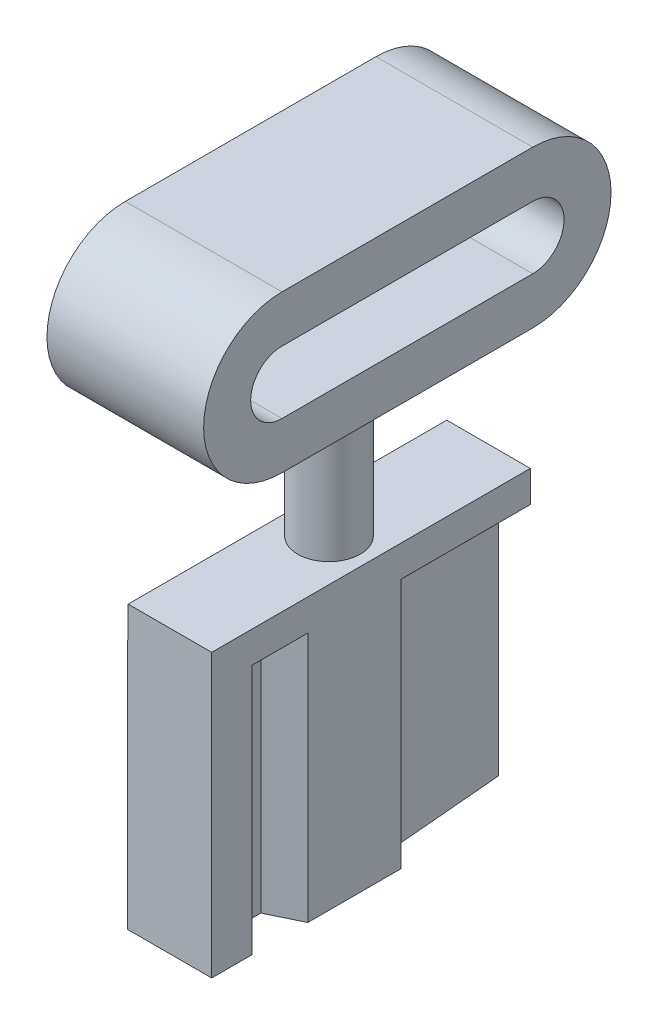
ISO-10303-21;
HEADER;
FILE_DESCRIPTION(('STEP AP214'),'2;1');
FILE_NAME('part.step','',(''),(''),'','','');
FILE_SCHEMA(('AUTOMOTIVE_DESIGN { 1 0 10303 214 1 1 1 1 }'));
ENDSEC;
DATA;
#1=APPLICATION_CONTEXT('core data for automotive mechanical design processes');
#2=APPLICATION_PROTOCOL_DEFINITION('international standard','automotive_design',2000,#1);
#3=PRODUCT_CONTEXT('',#1,'mechanical');
#4=PRODUCT('Part','Part','',(#3));
#5=PRODUCT_RELATED_PRODUCT_CATEGORY('part','',(#4));
#6=PRODUCT_DEFINITION_FORMATION('','',#4);
#7=PRODUCT_DEFINITION_CONTEXT('part definition',#1,'design');
#8=PRODUCT_DEFINITION('design','',#6,#7);
#9=PRODUCT_DEFINITION_SHAPE('','',#8);
#10=(LENGTH_UNIT() NAMED_UNIT(*) SI_UNIT(.MILLI.,.METRE.));
#11=(NAMED_UNIT(*) PLANE_ANGLE_UNIT() SI_UNIT($,.RADIAN.));
#12=(NAMED_UNIT(*) SI_UNIT($,.STERADIAN.) SOLID_ANGLE_UNIT());
#13=UNCERTAINTY_MEASURE_WITH_UNIT(LENGTH_MEASURE(1.E-05),#10,'distance_accuracy_value','');
#14=(GEOMETRIC_REPRESENTATION_CONTEXT(3) GLOBAL_UNCERTAINTY_ASSIGNED_CONTEXT((#13)) GLOBAL_UNIT_ASSIGNED_CONTEXT((#10,
#11,#12)) REPRESENTATION_CONTEXT('',''));
#15=CARTESIAN_POINT('',(0.,0.,0.));
#16=DIRECTION('',(0.,0.,1.));
#17=DIRECTION('',(1.,0.,0.));
#18=AXIS2_PLACEMENT_3D('',#15,#16,#17);
#19=CARTESIAN_POINT('',(0.,0.,0.));
#20=DIRECTION('',(0.,-1.,0.));
#21=DIRECTION('',(0.,0.,-1.));
#22=AXIS2_PLACEMENT_3D('',#19,#20,#21);
#23=PLANE('',#22);
#24=DIRECTION('',(0.,0.,1.));
#25=VECTOR('',#24,1.);
#26=CARTESIAN_POINT('',(-1.32550575745283,0.,5.08353990529874));
#27=LINE('',#26,#25);
#28=CARTESIAN_POINT('',(-1.32550575745283,0.,1.49301254358988));
#29=VERTEX_POINT('',#28);
#30=CARTESIAN_POINT('',(-1.32550575745283,0.,5.08353990529874));
#31=VERTEX_POINT('',#30);
#32=EDGE_CURVE('E46',#29,#31,#27,.T.);
#33=ORIENTED_EDGE('',*,*,#32,.F.);
#34=DIRECTION('',(-0.977998261827923,0.,0.208613038570365));
#35=VECTOR('',#34,1.);
#36=CARTESIAN_POINT('',(-1.34056311456887,0.,1.49622437038285));
#37=LINE('',#36,#35);
#38=CARTESIAN_POINT('',(-1.34056311456887,0.,1.49622437038285));
#39=VERTEX_POINT('',#38);
#40=EDGE_CURVE('E210',#29,#39,#37,.T.);
#41=ORIENTED_EDGE('',*,*,#40,.T.);
#42=DIRECTION('',(0.,0.,1.));
#43=VECTOR('',#42,1.);
#44=CARTESIAN_POINT('',(-1.34056311456887,0.,5.08353990529874));
#45=LINE('',#44,#43);
#46=CARTESIAN_POINT('',(-1.34056311456887,0.,5.08353990529874));
#47=VERTEX_POINT('',#46);
#48=EDGE_CURVE('E212',#39,#47,#45,.T.);
#49=ORIENTED_EDGE('',*,*,#48,.T.);
#50=DIRECTION('',(1.,0.,0.));
#51=VECTOR('',#50,1.);
#52=CARTESIAN_POINT('',(1.34056311456887,0.,5.08353990529874));
#53=LINE('',#52,#51);
#54=EDGE_CURVE('E184',#47,#31,#53,.T.);
#55=ORIENTED_EDGE('',*,*,#54,.T.);
#56=EDGE_LOOP('',(#33,#41,#49,#55));
#57=FACE_BOUND('',#56,.T.);
#58=ADVANCED_FACE('F37',(#57),#23,.F.);
#59=CARTESIAN_POINT('',(1.34056311456887,-8.,5.08353990529874));
#60=DIRECTION('',(0.,0.,1.));
#61=DIRECTION('',(1.,0.,0.));
#62=AXIS2_PLACEMENT_3D('',#59,#60,#61);
#63=PLANE('',#62);
#64=ORIENTED_EDGE('',*,*,#54,.F.);
#65=DIRECTION('',(0.,1.,0.));
#66=VECTOR('',#65,1.);
#67=CARTESIAN_POINT('',(-1.34056311456887,-8.,5.08353990529874));
#68=LINE('',#67,#66);
#69=CARTESIAN_POINT('',(-1.34056311456887,-8.,5.08353990529874));
#70=VERTEX_POINT('',#69);
#71=EDGE_CURVE('E62',#70,#47,#68,.T.);
#72=ORIENTED_EDGE('',*,*,#71,.F.);
#73=DIRECTION('',(1.,0.,0.));
#74=VECTOR('',#73,1.);
#75=CARTESIAN_POINT('',(1.34056311456887,-8.,5.08353990529874));
#76=LINE('',#75,#74);
#77=CARTESIAN_POINT('',(1.34056311456887,-8.,5.08353990529874));
#78=VERTEX_POINT('',#77);
#79=EDGE_CURVE('E215',#70,#78,#76,.T.);
#80=ORIENTED_EDGE('',*,*,#79,.T.);
#81=DIRECTION('',(0.,1.,0.));
#82=VECTOR('',#81,1.);
#83=CARTESIAN_POINT('',(1.34056311456887,-8.,5.08353990529874));
#84=LINE('',#83,#82);
#85=CARTESIAN_POINT('',(1.34056311456887,1.,5.08353990529874));
#86=VERTEX_POINT('',#85);
#87=EDGE_CURVE('E41',#78,#86,#84,.T.);
#88=ORIENTED_EDGE('',*,*,#87,.T.);
#89=DIRECTION('',(1.,0.,0.));
#90=VECTOR('',#89,1.);
#91=CARTESIAN_POINT('',(1.34056311456887,1.,5.08353990529874));
#92=LINE('',#91,#90);
#93=CARTESIAN_POINT('',(-1.32550575745283,1.,5.08353990529874));
#94=VERTEX_POINT('',#93);
#95=EDGE_CURVE('E241',#94,#86,#92,.T.);
#96=ORIENTED_EDGE('',*,*,#95,.F.);
#97=DIRECTION('',(0.,-1.,0.));
#98=VECTOR('',#97,1.);
#99=CARTESIAN_POINT('',(-1.32550575745283,1.,5.08353990529874));
#100=LINE('',#99,#98);
#101=EDGE_CURVE('E254',#94,#31,#100,.T.);
#102=ORIENTED_EDGE('',*,*,#101,.T.);
#103=EDGE_LOOP('',(#64,#72,#80,#88,#96,#102));
#104=FACE_BOUND('',#103,.T.);
#105=ADVANCED_FACE('F39',(#104),#63,.T.);
#106=CARTESIAN_POINT('',(-1.34056311456887,-8.,5.08353990529874));
#107=DIRECTION('',(-1.,0.,0.));
#108=DIRECTION('',(0.,0.,1.));
#109=AXIS2_PLACEMENT_3D('',#106,#107,#108);
#110=PLANE('',#109);
#111=ORIENTED_EDGE('',*,*,#48,.F.);
#112=DIRECTION('',(0.,1.,0.));
#113=VECTOR('',#112,1.);
#114=CARTESIAN_POINT('',(-1.34056311456887,-8.,1.49622437038285));
#115=LINE('',#114,#113);
#116=CARTESIAN_POINT('',(-1.34056311456887,-8.,1.49622437038285));
#117=VERTEX_POINT('',#116);
#118=EDGE_CURVE('E165',#117,#39,#115,.T.);
#119=ORIENTED_EDGE('',*,*,#118,.F.);
#120=DIRECTION('',(0.,0.,1.));
#121=VECTOR('',#120,1.);
#122=CARTESIAN_POINT('',(-1.34056311456887,-8.,5.08353990529874));
#123=LINE('',#122,#121);
#124=EDGE_CURVE('E174',#117,#70,#123,.T.);
#125=ORIENTED_EDGE('',*,*,#124,.T.);
#126=ORIENTED_EDGE('',*,*,#71,.T.);
#127=EDGE_LOOP('',(#111,#119,#125,#126));
#128=FACE_BOUND('',#127,.T.);
#129=ADVANCED_FACE('F354',(#128),#110,.T.);
#130=CARTESIAN_POINT('',(-1.34056311456887,-8.,1.49622437038285));
#131=DIRECTION('',(-0.208613038570365,0.,-0.977998261827923));
#132=DIRECTION('',(-0.977998261827923,0.,0.208613038570365));
#133=AXIS2_PLACEMENT_3D('',#130,#131,#132);
#134=PLANE('',#133);
#135=CARTESIAN_POINT('',(-0.253172839784197,0.,1.26427734328823));
#136=VERTEX_POINT('',#135);
#137=EDGE_CURVE('E160',#136,#29,#37,.T.);
#138=ORIENTED_EDGE('',*,*,#137,.F.);
#139=DIRECTION('',(0.,1.,0.));
#140=VECTOR('',#139,1.);
#141=CARTESIAN_POINT('',(-0.253172839784197,-8.,1.26427734328823));
#142=LINE('',#141,#140);
#143=CARTESIAN_POINT('',(-0.253172839784197,-8.,1.26427734328823));
#144=VERTEX_POINT('',#143);
#145=EDGE_CURVE('E153',#144,#136,#142,.T.);
#146=ORIENTED_EDGE('',*,*,#145,.F.);
#147=DIRECTION('',(-0.977998261827923,0.,0.208613038570365));
#148=VECTOR('',#147,1.);
#149=CARTESIAN_POINT('',(-1.34056311456887,-8.,1.49622437038285));
#150=LINE('',#149,#148);
#151=EDGE_CURVE('E157',#144,#117,#150,.T.);
#152=ORIENTED_EDGE('',*,*,#151,.T.);
#153=ORIENTED_EDGE('',*,*,#118,.T.);
#154=ORIENTED_EDGE('',*,*,#40,.F.);
#155=EDGE_LOOP('',(#138,#146,#152,#153,#154));
#156=FACE_BOUND('',#155,.T.);
#157=ADVANCED_FACE('F155',(#156),#134,.T.);
#158=CARTESIAN_POINT('',(-0.253172839784197,-8.,1.26427734328823));
#159=DIRECTION('',(-1.,0.,0.));
#160=DIRECTION('',(0.,0.,1.));
#161=AXIS2_PLACEMENT_3D('',#158,#159,#160);
#162=PLANE('',#161);
#163=DIRECTION('',(0.,0.,1.));
#164=VECTOR('',#163,1.);
#165=CARTESIAN_POINT('',(-0.253172839784197,0.,1.26427734328823));
#166=LINE('',#165,#164);
#167=CARTESIAN_POINT('',(-0.253172839784197,0.,0.218468371298806));
#168=VERTEX_POINT('',#167);
#169=EDGE_CURVE('E208',#168,#136,#166,.T.);
#170=ORIENTED_EDGE('',*,*,#169,.F.);
#171=DIRECTION('',(0.,1.,0.));
#172=VECTOR('',#171,1.);
#173=CARTESIAN_POINT('',(-0.253172839784197,-8.,0.218468371298806));
#174=LINE('',#173,#172);
#175=CARTESIAN_POINT('',(-0.253172839784197,-8.,0.218468371298806));
#176=VERTEX_POINT('',#175);
#177=EDGE_CURVE('E166',#176,#168,#174,.T.);
#178=ORIENTED_EDGE('',*,*,#177,.F.);
#179=DIRECTION('',(0.,0.,1.));
#180=VECTOR('',#179,1.);
#181=CARTESIAN_POINT('',(-0.253172839784197,-8.,1.26427734328823));
#182=LINE('',#181,#180);
#183=EDGE_CURVE('E172',#176,#144,#182,.T.);
#184=ORIENTED_EDGE('',*,*,#183,.T.);
#185=ORIENTED_EDGE('',*,*,#145,.T.);
#186=EDGE_LOOP('',(#170,#178,#184,#185));
#187=FACE_BOUND('',#186,.T.);
#188=ADVANCED_FACE('F176',(#187),#162,.T.);
#189=CARTESIAN_POINT('',(-0.253172839784197,-8.,0.218468371298806));
#190=DIRECTION('',(-0.707106781186546,0.,0.707106781186549));
#191=DIRECTION('',(0.707106781186549,0.,0.707106781186546));
#192=AXIS2_PLACEMENT_3D('',#189,#190,#191);
#193=PLANE('',#192);
#194=DIRECTION('',(0.707106781186549,0.,0.707106781186546));
#195=VECTOR('',#194,1.);
#196=CARTESIAN_POINT('',(-0.253172839784197,0.,0.218468371298806));
#197=LINE('',#196,#195);
#198=CARTESIAN_POINT('',(-1.1287338395893,0.,-0.657092628506291));
#199=VERTEX_POINT('',#198);
#200=EDGE_CURVE('E205',#199,#168,#197,.T.);
#201=ORIENTED_EDGE('',*,*,#200,.F.);
#202=DIRECTION('',(0.,1.,0.));
#203=VECTOR('',#202,1.);
#204=CARTESIAN_POINT('',(-1.1287338395893,-8.,-0.657092628506291));
#205=LINE('',#204,#203);
#206=CARTESIAN_POINT('',(-1.1287338395893,-8.,-0.657092628506291));
#207=VERTEX_POINT('',#206);
#208=EDGE_CURVE('E219',#207,#199,#205,.T.);
#209=ORIENTED_EDGE('',*,*,#208,.F.);
#210=DIRECTION('',(0.707106781186549,0.,0.707106781186546));
#211=VECTOR('',#210,1.);
#212=CARTESIAN_POINT('',(-0.253172839784197,-8.,0.218468371298806));
#213=LINE('',#212,#211);
#214=EDGE_CURVE('E177',#207,#176,#213,.T.);
#215=ORIENTED_EDGE('',*,*,#214,.T.);
#216=ORIENTED_EDGE('',*,*,#177,.T.);
#217=EDGE_LOOP('',(#201,#209,#215,#216));
#218=FACE_BOUND('',#217,.T.);
#219=ADVANCED_FACE('F363',(#218),#193,.T.);
#220=CARTESIAN_POINT('',(-1.1287338395893,-8.,-0.657092628506291));
#221=DIRECTION('',(-0.999261174631314,0.,-0.038433122101205));
#222=DIRECTION('',(-0.038433122101205,0.,0.999261174631314));
#223=AXIS2_PLACEMENT_3D('',#220,#221,#222);
#224=PLANE('',#223);
#225=DIRECTION('',(-0.038433122101205,0.,0.999261174631314));
#226=VECTOR('',#225,1.);
#227=CARTESIAN_POINT('',(-1.1287338395893,0.,-0.657092628506291));
#228=LINE('',#227,#226);
#229=CARTESIAN_POINT('',(-0.95848586740497,0.,-5.08353990529874));
#230=VERTEX_POINT('',#229);
#231=EDGE_CURVE('E202',#230,#199,#228,.T.);
#232=ORIENTED_EDGE('',*,*,#231,.F.);
#233=DIRECTION('',(0.,1.,0.));
#234=VECTOR('',#233,1.);
#235=CARTESIAN_POINT('',(-0.95848586740497,-8.,-5.08353990529874));
#236=LINE('',#235,#234);
#237=CARTESIAN_POINT('',(-0.95848586740497,-8.,-5.08353990529874));
#238=VERTEX_POINT('',#237);
#239=EDGE_CURVE('E221',#238,#230,#236,.T.);
#240=ORIENTED_EDGE('',*,*,#239,.F.);
#241=DIRECTION('',(-0.038433122101205,0.,0.999261174631314));
#242=VECTOR('',#241,1.);
#243=CARTESIAN_POINT('',(-1.1287338395893,-8.,-0.657092628506291));
#244=LINE('',#243,#242);
#245=EDGE_CURVE('E179',#238,#207,#244,.T.);
#246=ORIENTED_EDGE('',*,*,#245,.T.);
#247=ORIENTED_EDGE('',*,*,#208,.T.);
#248=EDGE_LOOP('',(#232,#240,#246,#247));
#249=FACE_BOUND('',#248,.T.);
#250=ADVANCED_FACE('F308',(#249),#224,.T.);
#251=CARTESIAN_POINT('',(-0.95848586740497,-8.,-5.08353990529874));
#252=DIRECTION('',(0.,0.,-1.));
#253=DIRECTION('',(-1.,0.,0.));
#254=AXIS2_PLACEMENT_3D('',#251,#252,#253);
#255=PLANE('',#254);
#256=ORIENTED_EDGE('',*,*,#239,.T.);
#257=DIRECTION('',(-1.,0.,0.));
#258=VECTOR('',#257,1.);
#259=CARTESIAN_POINT('',(1.34056311456887,0.,-5.08353990529874));
#260=LINE('',#259,#258);
#261=CARTESIAN_POINT('',(-1.32550575745283,0.,-5.08353990529874));
#262=VERTEX_POINT('',#261);
#263=EDGE_CURVE('E274',#230,#262,#260,.T.);
#264=ORIENTED_EDGE('',*,*,#263,.T.);
#265=DIRECTION('',(0.,-1.,0.));
#266=VECTOR('',#265,1.);
#267=CARTESIAN_POINT('',(-1.32550575745283,1.,-5.08353990529874));
#268=LINE('',#267,#266);
#269=CARTESIAN_POINT('',(-1.32550575745283,1.,-5.08353990529874));
#270=VERTEX_POINT('',#269);
#271=EDGE_CURVE('E277',#270,#262,#268,.T.);
#272=ORIENTED_EDGE('',*,*,#271,.F.);
#273=DIRECTION('',(-1.,0.,0.));
#274=VECTOR('',#273,1.);
#275=CARTESIAN_POINT('',(1.34056311456887,1.,-5.08353990529874));
#276=LINE('',#275,#274);
#277=CARTESIAN_POINT('',(1.34056311456887,1.,-5.08353990529874));
#278=VERTEX_POINT('',#277);
#279=EDGE_CURVE('E259',#278,#270,#276,.T.);
#280=ORIENTED_EDGE('',*,*,#279,.F.);
#281=DIRECTION('',(0.,-1.,0.));
#282=VECTOR('',#281,1.);
#283=CARTESIAN_POINT('',(1.34056311456887,1.,-5.08353990529874));
#284=LINE('',#283,#282);
#285=CARTESIAN_POINT('',(1.34056311456887,0.,-5.08353990529874));
#286=VERTEX_POINT('',#285);
#287=EDGE_CURVE('E187',#278,#286,#284,.T.);
#288=ORIENTED_EDGE('',*,*,#287,.T.);
#289=CARTESIAN_POINT('',(0.330534493419205,0.,-5.08353990529874));
#290=VERTEX_POINT('',#289);
#291=EDGE_CURVE('E264',#286,#290,#260,.T.);
#292=ORIENTED_EDGE('',*,*,#291,.T.);
#293=DIRECTION('',(0.,1.,0.));
#294=VECTOR('',#293,1.);
#295=CARTESIAN_POINT('',(0.330534493419205,-8.,-5.08353990529874));
#296=LINE('',#295,#294);
#297=CARTESIAN_POINT('',(0.330534493419205,-8.,-5.08353990529874));
#298=VERTEX_POINT('',#297);
#299=EDGE_CURVE('E223',#298,#290,#296,.T.);
#300=ORIENTED_EDGE('',*,*,#299,.F.);
#301=DIRECTION('',(-1.,0.,0.));
#302=VECTOR('',#301,1.);
#303=CARTESIAN_POINT('',(-0.95848586740497,-8.,-5.08353990529874));
#304=LINE('',#303,#302);
#305=EDGE_CURVE('E302',#298,#238,#304,.T.);
#306=ORIENTED_EDGE('',*,*,#305,.T.);
#307=EDGE_LOOP('',(#256,#264,#272,#280,#288,#292,#300,#306));
#308=FACE_BOUND('',#307,.T.);
#309=ADVANCED_FACE('F313',(#308),#255,.T.);
#310=CARTESIAN_POINT('',(0.330534493419205,-8.,-5.08353990529874));
#311=DIRECTION('',(0.996329982716306,0.,-0.0855953593398879));
#312=DIRECTION('',(-0.0855953593398879,0.,-0.996329982716307));
#313=AXIS2_PLACEMENT_3D('',#310,#311,#312);
#314=PLANE('',#313);
#315=DIRECTION('',(-0.0855953593398879,0.,-0.996329982716307));
#316=VECTOR('',#315,1.);
#317=CARTESIAN_POINT('',(0.330534493419205,0.,-5.08353990529874));
#318=LINE('',#317,#316);
#319=CARTESIAN_POINT('',(0.634548729462639,0.,-1.54481419775313));
#320=VERTEX_POINT('',#319);
#321=EDGE_CURVE('E199',#320,#290,#318,.T.);
#322=ORIENTED_EDGE('',*,*,#321,.F.);
#323=DIRECTION('',(0.,1.,0.));
#324=VECTOR('',#323,1.);
#325=CARTESIAN_POINT('',(0.634548729462639,-8.,-1.54481419775313));
#326=LINE('',#325,#324);
#327=CARTESIAN_POINT('',(0.634548729462639,-8.,-1.54481419775313));
#328=VERTEX_POINT('',#327);
#329=EDGE_CURVE('E225',#328,#320,#326,.T.);
#330=ORIENTED_EDGE('',*,*,#329,.F.);
#331=DIRECTION('',(-0.0855953593398879,0.,-0.996329982716307));
#332=VECTOR('',#331,1.);
#333=CARTESIAN_POINT('',(0.330534493419205,-8.,-5.08353990529874));
#334=LINE('',#333,#332);
#335=EDGE_CURVE('E299',#328,#298,#334,.T.);
#336=ORIENTED_EDGE('',*,*,#335,.T.);
#337=ORIENTED_EDGE('',*,*,#299,.T.);
#338=EDGE_LOOP('',(#322,#330,#336,#337));
#339=FACE_BOUND('',#338,.T.);
#340=ADVANCED_FACE('F318',(#339),#314,.T.);
#341=CARTESIAN_POINT('',(0.634548729462639,-8.,-1.54481419775313));
#342=DIRECTION('',(0.64398662805083,0.,-0.76503674610552));
#343=DIRECTION('',(-0.76503674610552,0.,-0.64398662805083));
#344=AXIS2_PLACEMENT_3D('',#341,#342,#343);
#345=PLANE('',#344);
#346=DIRECTION('',(-0.76503674610552,0.,-0.64398662805083));
#347=VECTOR('',#346,1.);
#348=CARTESIAN_POINT('',(0.634548729462639,0.,-1.54481419775313));
#349=LINE('',#348,#347);
#350=CARTESIAN_POINT('',(1.34056311456887,0.,-0.950510949530816));
#351=VERTEX_POINT('',#350);
#352=EDGE_CURVE('E196',#351,#320,#349,.T.);
#353=ORIENTED_EDGE('',*,*,#352,.F.);
#354=DIRECTION('',(0.,1.,0.));
#355=VECTOR('',#354,1.);
#356=CARTESIAN_POINT('',(1.34056311456887,-8.,-0.950510949530816));
#357=LINE('',#356,#355);
#358=CARTESIAN_POINT('',(1.34056311456887,-8.,-0.950510949530816));
#359=VERTEX_POINT('',#358);
#360=EDGE_CURVE('E227',#359,#351,#357,.T.);
#361=ORIENTED_EDGE('',*,*,#360,.F.);
#362=DIRECTION('',(-0.76503674610552,0.,-0.64398662805083));
#363=VECTOR('',#362,1.);
#364=CARTESIAN_POINT('',(0.634548729462639,-8.,-1.54481419775313));
#365=LINE('',#364,#363);
#366=EDGE_CURVE('E296',#359,#328,#365,.T.);
#367=ORIENTED_EDGE('',*,*,#366,.T.);
#368=ORIENTED_EDGE('',*,*,#329,.T.);
#369=EDGE_LOOP('',(#353,#361,#367,#368));
#370=FACE_BOUND('',#369,.T.);
#371=ADVANCED_FACE('F325',(#370),#345,.T.);
#372=CARTESIAN_POINT('',(1.34056311456887,-8.,-0.950510949530816));
#373=DIRECTION('',(1.,0.,0.));
#374=DIRECTION('',(0.,0.,-1.));
#375=AXIS2_PLACEMENT_3D('',#372,#373,#374);
#376=PLANE('',#375);
#377=ORIENTED_EDGE('',*,*,#360,.T.);
#378=DIRECTION('',(0.,0.,-1.));
#379=VECTOR('',#378,1.);
#380=CARTESIAN_POINT('',(1.34056311456887,0.,5.08353990529874));
#381=LINE('',#380,#379);
#382=EDGE_CURVE('E269',#351,#286,#381,.T.);
#383=ORIENTED_EDGE('',*,*,#382,.T.);
#384=ORIENTED_EDGE('',*,*,#287,.F.);
#385=DIRECTION('',(0.,0.,-1.));
#386=VECTOR('',#385,1.);
#387=CARTESIAN_POINT('',(1.34056311456887,1.,5.08353990529874));
#388=LINE('',#387,#386);
#389=EDGE_CURVE('E249',#86,#278,#388,.T.);
#390=ORIENTED_EDGE('',*,*,#389,.F.);
#391=ORIENTED_EDGE('',*,*,#87,.F.);
#392=DIRECTION('',(0.,0.,-1.));
#393=VECTOR('',#392,1.);
#394=CARTESIAN_POINT('',(1.34056311456887,-8.,3.79367578716963));
#395=LINE('',#394,#393);
#396=CARTESIAN_POINT('',(1.34056311456887,-8.,3.79367578716963));
#397=VERTEX_POINT('',#396);
#398=EDGE_CURVE('E282',#78,#397,#395,.T.);
#399=ORIENTED_EDGE('',*,*,#398,.T.);
#400=DIRECTION('',(0.,1.,0.));
#401=VECTOR('',#400,1.);
#402=CARTESIAN_POINT('',(1.34056311456887,-8.,3.79367578716963));
#403=LINE('',#402,#401);
#404=CARTESIAN_POINT('',(1.34056311456887,0.,3.79367578716963));
#405=VERTEX_POINT('',#404);
#406=EDGE_CURVE('E234',#397,#405,#403,.T.);
#407=ORIENTED_EDGE('',*,*,#406,.T.);
#408=CARTESIAN_POINT('',(1.34056311456887,0.,2.01823264867596));
#409=VERTEX_POINT('',#408);
#410=EDGE_CURVE('E271',#405,#409,#381,.T.);
#411=ORIENTED_EDGE('',*,*,#410,.T.);
#412=DIRECTION('',(0.,1.,0.));
#413=VECTOR('',#412,1.);
#414=CARTESIAN_POINT('',(1.34056311456887,-8.,2.01823264867596));
#415=LINE('',#414,#413);
#416=CARTESIAN_POINT('',(1.34056311456887,-8.,2.01823264867596));
#417=VERTEX_POINT('',#416);
#418=EDGE_CURVE('E229',#417,#409,#415,.T.);
#419=ORIENTED_EDGE('',*,*,#418,.F.);
#420=DIRECTION('',(0.,0.,-1.));
#421=VECTOR('',#420,1.);
#422=CARTESIAN_POINT('',(1.34056311456887,-8.,-0.950510949530816));
#423=LINE('',#422,#421);
#424=EDGE_CURVE('E293',#417,#359,#423,.T.);
#425=ORIENTED_EDGE('',*,*,#424,.T.);
#426=EDGE_LOOP('',(#377,#383,#384,#390,#391,#399,#407,#411,#419,#425));
#427=FACE_BOUND('',#426,.T.);
#428=ADVANCED_FACE('F256',(#427),#376,.T.);
#429=CARTESIAN_POINT('',(1.34056311456887,-8.,2.01823264867596));
#430=DIRECTION('',(0.433897228470505,0.,0.900962371648014));
#431=DIRECTION('',(0.900962371648014,0.,-0.433897228470505));
#432=AXIS2_PLACEMENT_3D('',#429,#430,#431);
#433=PLANE('',#432);
#434=DIRECTION('',(0.900962371648014,0.,-0.433897228470505));
#435=VECTOR('',#434,1.);
#436=CARTESIAN_POINT('',(1.34056311456887,0.,2.01823264867596));
#437=LINE('',#436,#435);
#438=CARTESIAN_POINT('',(0.330534493419205,0.,2.50465542634546));
#439=VERTEX_POINT('',#438);
#440=EDGE_CURVE('E193',#439,#409,#437,.T.);
#441=ORIENTED_EDGE('',*,*,#440,.F.);
#442=DIRECTION('',(0.,1.,0.));
#443=VECTOR('',#442,1.);
#444=CARTESIAN_POINT('',(0.330534493419205,-8.,2.50465542634546));
#445=LINE('',#444,#443);
#446=CARTESIAN_POINT('',(0.330534493419205,-8.,2.50465542634546));
#447=VERTEX_POINT('',#446);
#448=EDGE_CURVE('E231',#447,#439,#445,.T.);
#449=ORIENTED_EDGE('',*,*,#448,.F.);
#450=DIRECTION('',(0.900962371648014,0.,-0.433897228470505));
#451=VECTOR('',#450,1.);
#452=CARTESIAN_POINT('',(1.34056311456887,-8.,2.01823264867596));
#453=LINE('',#452,#451);
#454=EDGE_CURVE('E290',#447,#417,#453,.T.);
#455=ORIENTED_EDGE('',*,*,#454,.T.);
#456=ORIENTED_EDGE('',*,*,#418,.T.);
#457=EDGE_LOOP('',(#441,#449,#455,#456));
#458=FACE_BOUND('',#457,.T.);
#459=ADVANCED_FACE('F332',(#458),#433,.T.);
#460=CARTESIAN_POINT('',(0.330534493419205,-8.,2.50465542634546));
#461=DIRECTION('',(1.,0.,0.));
#462=DIRECTION('',(0.,0.,-1.));
#463=AXIS2_PLACEMENT_3D('',#460,#461,#462);
#464=PLANE('',#463);
#465=DIRECTION('',(0.,0.,-1.));
#466=VECTOR('',#465,1.);
#467=CARTESIAN_POINT('',(0.330534493419205,0.,2.50465542634546));
#468=LINE('',#467,#466);
#469=CARTESIAN_POINT('',(0.330534493419205,0.,3.2898821378408));
#470=VERTEX_POINT('',#469);
#471=EDGE_CURVE('E190',#470,#439,#468,.T.);
#472=ORIENTED_EDGE('',*,*,#471,.F.);
#473=DIRECTION('',(0.,1.,0.));
#474=VECTOR('',#473,1.);
#475=CARTESIAN_POINT('',(0.330534493419205,-8.,3.2898821378408));
#476=LINE('',#475,#474);
#477=CARTESIAN_POINT('',(0.330534493419205,-8.,3.2898821378408));
#478=VERTEX_POINT('',#477);
#479=EDGE_CURVE('E233',#478,#470,#476,.T.);
#480=ORIENTED_EDGE('',*,*,#479,.F.);
#481=DIRECTION('',(0.,0.,-1.));
#482=VECTOR('',#481,1.);
#483=CARTESIAN_POINT('',(0.330534493419205,-8.,2.50465542634546));
#484=LINE('',#483,#482);
#485=EDGE_CURVE('E287',#478,#447,#484,.T.);
#486=ORIENTED_EDGE('',*,*,#485,.T.);
#487=ORIENTED_EDGE('',*,*,#448,.T.);
#488=EDGE_LOOP('',(#472,#480,#486,#487));
#489=FACE_BOUND('',#488,.T.);
#490=ADVANCED_FACE('F337',(#489),#464,.T.);
#491=CARTESIAN_POINT('',(0.330534493419205,-8.,3.2898821378408));
#492=DIRECTION('',(0.446348206720458,0.,-0.894859362334345));
#493=DIRECTION('',(-0.894859362334345,0.,-0.446348206720458));
#494=AXIS2_PLACEMENT_3D('',#491,#492,#493);
#495=PLANE('',#494);
#496=DIRECTION('',(-0.894859362334345,0.,-0.446348206720458));
#497=VECTOR('',#496,1.);
#498=CARTESIAN_POINT('',(0.330534493419205,0.,3.2898821378408));
#499=LINE('',#498,#497);
#500=EDGE_CURVE('E186',#405,#470,#499,.T.);
#501=ORIENTED_EDGE('',*,*,#500,.F.);
#502=ORIENTED_EDGE('',*,*,#406,.F.);
#503=DIRECTION('',(-0.894859362334345,0.,-0.446348206720458));
#504=VECTOR('',#503,1.);
#505=CARTESIAN_POINT('',(0.330534493419205,-8.,3.2898821378408));
#506=LINE('',#505,#504);
#507=EDGE_CURVE('E284',#397,#478,#506,.T.);
#508=ORIENTED_EDGE('',*,*,#507,.T.);
#509=ORIENTED_EDGE('',*,*,#479,.T.);
#510=EDGE_LOOP('',(#501,#502,#508,#509));
#511=FACE_BOUND('',#510,.T.);
#512=ADVANCED_FACE('F341',(#511),#495,.T.);
#513=CARTESIAN_POINT('',(0.,-8.,0.));
#514=DIRECTION('',(0.,-1.,0.));
#515=DIRECTION('',(0.,0.,-1.));
#516=AXIS2_PLACEMENT_3D('',#513,#514,#515);
#517=PLANE('',#516);
#518=ORIENTED_EDGE('',*,*,#79,.F.);
#519=ORIENTED_EDGE('',*,*,#124,.F.);
#520=ORIENTED_EDGE('',*,*,#151,.F.);
#521=ORIENTED_EDGE('',*,*,#183,.F.);
#522=ORIENTED_EDGE('',*,*,#214,.F.);
#523=ORIENTED_EDGE('',*,*,#245,.F.);
#524=ORIENTED_EDGE('',*,*,#305,.F.);
#525=ORIENTED_EDGE('',*,*,#335,.F.);
#526=ORIENTED_EDGE('',*,*,#366,.F.);
#527=ORIENTED_EDGE('',*,*,#424,.F.);
#528=ORIENTED_EDGE('',*,*,#454,.F.);
#529=ORIENTED_EDGE('',*,*,#485,.F.);
#530=ORIENTED_EDGE('',*,*,#507,.F.);
#531=ORIENTED_EDGE('',*,*,#398,.F.);
#532=EDGE_LOOP('',(#518,#519,#520,#521,#522,#523,#524,#525,#526,#527,#528,#529,#530,#531));
#533=FACE_BOUND('',#532,.T.);
#534=ADVANCED_FACE('F170',(#533),#517,.T.);
#535=CARTESIAN_POINT('',(0.,0.,0.));
#536=DIRECTION('',(0.,1.,0.));
#537=DIRECTION('',(0.,0.,1.));
#538=AXIS2_PLACEMENT_3D('',#535,#536,#537);
#539=PLANE('',#538);
#540=ORIENTED_EDGE('',*,*,#410,.F.);
#541=ORIENTED_EDGE('',*,*,#500,.T.);
#542=ORIENTED_EDGE('',*,*,#471,.T.);
#543=ORIENTED_EDGE('',*,*,#440,.T.);
#544=EDGE_LOOP('',(#540,#541,#542,#543));
#545=FACE_BOUND('',#544,.T.);
#546=ADVANCED_FACE('F334',(#545),#539,.F.);
#547=ORIENTED_EDGE('',*,*,#382,.F.);
#548=ORIENTED_EDGE('',*,*,#352,.T.);
#549=ORIENTED_EDGE('',*,*,#321,.T.);
#550=ORIENTED_EDGE('',*,*,#291,.F.);
#551=EDGE_LOOP('',(#547,#548,#549,#550));
#552=FACE_BOUND('',#551,.T.);
#553=ADVANCED_FACE('F321',(#552),#539,.F.);
#554=ORIENTED_EDGE('',*,*,#263,.F.);
#555=ORIENTED_EDGE('',*,*,#231,.T.);
#556=ORIENTED_EDGE('',*,*,#200,.T.);
#557=ORIENTED_EDGE('',*,*,#169,.T.);
#558=ORIENTED_EDGE('',*,*,#137,.T.);
#559=EDGE_CURVE('E260',#262,#29,#27,.T.);
#560=ORIENTED_EDGE('',*,*,#559,.F.);
#561=EDGE_LOOP('',(#554,#555,#556,#557,#558,#560));
#562=FACE_BOUND('',#561,.T.);
#563=ADVANCED_FACE('F401',(#562),#539,.F.);
#564=CARTESIAN_POINT('',(-1.32550575745283,1.,5.08353990529874));
#565=DIRECTION('',(1.,0.,0.));
#566=DIRECTION('',(0.,0.,-1.));
#567=AXIS2_PLACEMENT_3D('',#564,#565,#566);
#568=PLANE('',#567);
#569=ORIENTED_EDGE('',*,*,#559,.T.);
#570=ORIENTED_EDGE('',*,*,#32,.T.);
#571=ORIENTED_EDGE('',*,*,#101,.F.);
#572=DIRECTION('',(0.,0.,1.));
#573=VECTOR('',#572,1.);
#574=CARTESIAN_POINT('',(-1.32550575745283,1.,5.08353990529874));
#575=LINE('',#574,#573);
#576=EDGE_CURVE('E252',#270,#94,#575,.T.);
#577=ORIENTED_EDGE('',*,*,#576,.F.);
#578=ORIENTED_EDGE('',*,*,#271,.T.);
#579=EDGE_LOOP('',(#569,#570,#571,#577,#578));
#580=FACE_BOUND('',#579,.T.);
#581=ADVANCED_FACE('F417',(#580),#568,.F.);
#582=CARTESIAN_POINT('',(0.,1.,0.));
#583=DIRECTION('',(0.,1.,0.));
#584=DIRECTION('',(0.,0.,1.));
#585=AXIS2_PLACEMENT_3D('',#582,#583,#584);
#586=PLANE('',#585);
#587=CARTESIAN_POINT('',(0.,1.,0.));
#588=DIRECTION('',(0.,1.,0.));
#589=DIRECTION('',(0.,0.,1.));
#590=AXIS2_PLACEMENT_3D('',#587,#588,#589);
#591=CIRCLE('',#590,1.);
#592=CARTESIAN_POINT('',(0.,1.,1.));
#593=VERTEX_POINT('',#592);
#594=EDGE_CURVE('E11',#593,#593,#591,.T.);
#595=ORIENTED_EDGE('',*,*,#594,.F.);
#596=EDGE_LOOP('',(#595));
#597=FACE_BOUND('',#596,.T.);
#598=ORIENTED_EDGE('',*,*,#389,.T.);
#599=ORIENTED_EDGE('',*,*,#279,.T.);
#600=ORIENTED_EDGE('',*,*,#576,.T.);
#601=ORIENTED_EDGE('',*,*,#95,.T.);
#602=EDGE_LOOP('',(#598,#599,#600,#601));
#603=FACE_BOUND('',#602,.T.);
#604=ADVANCED_FACE('F246',(#597,#603),#586,.T.);
#605=CARTESIAN_POINT('',(0.,6.,0.));
#606=DIRECTION('',(0.,-1.,0.));
#607=DIRECTION('',(0.,0.,-1.));
#608=AXIS2_PLACEMENT_3D('',#605,#606,#607);
#609=CYLINDRICAL_SURFACE('',#608,1.);
#610=CARTESIAN_POINT('',(0.,6.,0.));
#611=DIRECTION('',(0.,1.,0.));
#612=DIRECTION('',(0.,0.,1.));
#613=AXIS2_PLACEMENT_3D('',#610,#611,#612);
#614=CIRCLE('',#613,1.);
#615=CARTESIAN_POINT('',(0.,6.,1.));
#616=VERTEX_POINT('',#615);
#617=EDGE_CURVE('E272',#616,#616,#614,.T.);
#618=ORIENTED_EDGE('',*,*,#617,.F.);
#619=EDGE_LOOP('',(#618));
#620=FACE_BOUND('',#619,.T.);
#621=ORIENTED_EDGE('',*,*,#594,.T.);
#622=EDGE_LOOP('',(#621));
#623=FACE_BOUND('',#622,.T.);
#624=ADVANCED_FACE('F434',(#620,#623),#609,.T.);
#625=CARTESIAN_POINT('',(2.5,8.5,4.));
#626=DIRECTION('',(1.,0.,0.));
#627=DIRECTION('',(0.,0.,-1.));
#628=AXIS2_PLACEMENT_3D('',#625,#626,#627);
#629=PLANE('',#628);
#630=CARTESIAN_POINT('',(2.5,8.5,4.));
#631=DIRECTION('',(1.,0.,0.));
#632=DIRECTION('',(0.,0.,-1.));
#633=AXIS2_PLACEMENT_3D('',#630,#631,#632);
#634=CIRCLE('',#633,2.5);
#635=CARTESIAN_POINT('',(2.5,11.,4.));
#636=VERTEX_POINT('',#635);
#637=CARTESIAN_POINT('',(2.5,6.,4.));
#638=VERTEX_POINT('',#637);
#639=EDGE_CURVE('E591',#636,#638,#634,.T.);
#640=ORIENTED_EDGE('',*,*,#639,.T.);
#641=DIRECTION('',(0.,0.,-1.));
#642=VECTOR('',#641,1.);
#643=CARTESIAN_POINT('',(2.5,6.,4.));
#644=LINE('',#643,#642);
#645=CARTESIAN_POINT('',(2.5,6.,-4.));
#646=VERTEX_POINT('',#645);
#647=EDGE_CURVE('E594',#638,#646,#644,.T.);
#648=ORIENTED_EDGE('',*,*,#647,.T.);
#649=CARTESIAN_POINT('',(2.5,8.5,-4.));
#650=DIRECTION('',(1.,0.,0.));
#651=DIRECTION('',(0.,0.,-1.));
#652=AXIS2_PLACEMENT_3D('',#649,#650,#651);
#653=CIRCLE('',#652,2.5);
#654=CARTESIAN_POINT('',(2.5,11.,-4.));
#655=VERTEX_POINT('',#654);
#656=EDGE_CURVE('E598',#646,#655,#653,.T.);
#657=ORIENTED_EDGE('',*,*,#656,.T.);
#658=DIRECTION('',(0.,0.,1.));
#659=VECTOR('',#658,1.);
#660=CARTESIAN_POINT('',(2.5,11.,4.));
#661=LINE('',#660,#659);
#662=EDGE_CURVE('E601',#655,#636,#661,.T.);
#663=ORIENTED_EDGE('',*,*,#662,.T.);
#664=EDGE_LOOP('',(#640,#648,#657,#663));
#665=FACE_BOUND('',#664,.T.);
#666=DIRECTION('',(0.,0.,-1.));
#667=VECTOR('',#666,1.);
#668=CARTESIAN_POINT('',(2.5,7.5,4.));
#669=LINE('',#668,#667);
#670=CARTESIAN_POINT('',(2.5,7.5,4.));
#671=VERTEX_POINT('',#670);
#672=CARTESIAN_POINT('',(2.5,7.5,-4.));
#673=VERTEX_POINT('',#672);
#674=EDGE_CURVE('E682',#671,#673,#669,.T.);
#675=ORIENTED_EDGE('',*,*,#674,.F.);
#676=CARTESIAN_POINT('',(2.5,8.5,4.));
#677=DIRECTION('',(1.,0.,0.));
#678=DIRECTION('',(0.,0.,-1.));
#679=AXIS2_PLACEMENT_3D('',#676,#677,#678);
#680=CIRCLE('',#679,0.999999999999999);
#681=CARTESIAN_POINT('',(2.5,9.5,4.));
#682=VERTEX_POINT('',#681);
#683=EDGE_CURVE('E568',#682,#671,#680,.T.);
#684=ORIENTED_EDGE('',*,*,#683,.F.);
#685=DIRECTION('',(0.,0.,1.));
#686=VECTOR('',#685,1.);
#687=CARTESIAN_POINT('',(2.5,9.5,4.));
#688=LINE('',#687,#686);
#689=CARTESIAN_POINT('',(2.5,9.5,-4.));
#690=VERTEX_POINT('',#689);
#691=EDGE_CURVE('E582',#690,#682,#688,.T.);
#692=ORIENTED_EDGE('',*,*,#691,.F.);
#693=CARTESIAN_POINT('',(2.5,8.5,-4.));
#694=DIRECTION('',(1.,0.,0.));
#695=DIRECTION('',(0.,0.,-1.));
#696=AXIS2_PLACEMENT_3D('',#693,#694,#695);
#697=CIRCLE('',#696,0.999999999999999);
#698=EDGE_CURVE('E680',#673,#690,#697,.T.);
#699=ORIENTED_EDGE('',*,*,#698,.F.);
#700=EDGE_LOOP('',(#675,#684,#692,#699));
#701=FACE_BOUND('',#700,.T.);
#702=ADVANCED_FACE('F444',(#665,#701),#629,.T.);
#703=CARTESIAN_POINT('',(-2.5,8.5,4.));
#704=DIRECTION('',(1.,0.,0.));
#705=DIRECTION('',(0.,0.,-1.));
#706=AXIS2_PLACEMENT_3D('',#703,#704,#705);
#707=PLANE('',#706);
#708=CARTESIAN_POINT('',(-2.5,8.5,4.));
#709=DIRECTION('',(1.,0.,0.));
#710=DIRECTION('',(0.,0.,-1.));
#711=AXIS2_PLACEMENT_3D('',#708,#709,#710);
#712=CIRCLE('',#711,2.5);
#713=CARTESIAN_POINT('',(-2.5,11.,4.));
#714=VERTEX_POINT('',#713);
#715=CARTESIAN_POINT('',(-2.5,6.,4.));
#716=VERTEX_POINT('',#715);
#717=EDGE_CURVE('E590',#714,#716,#712,.T.);
#718=ORIENTED_EDGE('',*,*,#717,.F.);
#719=DIRECTION('',(0.,0.,1.));
#720=VECTOR('',#719,1.);
#721=CARTESIAN_POINT('',(-2.5,11.,4.));
#722=LINE('',#721,#720);
#723=CARTESIAN_POINT('',(-2.5,11.,-4.));
#724=VERTEX_POINT('',#723);
#725=EDGE_CURVE('E595',#724,#714,#722,.T.);
#726=ORIENTED_EDGE('',*,*,#725,.F.);
#727=CARTESIAN_POINT('',(-2.5,8.5,-4.));
#728=DIRECTION('',(1.,0.,0.));
#729=DIRECTION('',(0.,0.,-1.));
#730=AXIS2_PLACEMENT_3D('',#727,#728,#729);
#731=CIRCLE('',#730,2.5);
#732=CARTESIAN_POINT('',(-2.5,6.,-4.));
#733=VERTEX_POINT('',#732);
#734=EDGE_CURVE('E610',#733,#724,#731,.T.);
#735=ORIENTED_EDGE('',*,*,#734,.F.);
#736=DIRECTION('',(0.,0.,-1.));
#737=VECTOR('',#736,1.);
#738=CARTESIAN_POINT('',(-2.5,6.,4.));
#739=LINE('',#738,#737);
#740=EDGE_CURVE('E607',#716,#733,#739,.T.);
#741=ORIENTED_EDGE('',*,*,#740,.F.);
#742=EDGE_LOOP('',(#718,#726,#735,#741));
#743=FACE_BOUND('',#742,.T.);
#744=CARTESIAN_POINT('',(-2.5,8.5,4.));
#745=DIRECTION('',(1.,0.,0.));
#746=DIRECTION('',(0.,0.,-1.));
#747=AXIS2_PLACEMENT_3D('',#744,#745,#746);
#748=CIRCLE('',#747,0.999999999999999);
#749=CARTESIAN_POINT('',(-2.5,9.5,4.));
#750=VERTEX_POINT('',#749);
#751=CARTESIAN_POINT('',(-2.5,7.5,4.));
#752=VERTEX_POINT('',#751);
#753=EDGE_CURVE('E577',#750,#752,#748,.T.);
#754=ORIENTED_EDGE('',*,*,#753,.T.);
#755=DIRECTION('',(0.,0.,-1.));
#756=VECTOR('',#755,1.);
#757=CARTESIAN_POINT('',(-2.5,7.5,4.));
#758=LINE('',#757,#756);
#759=CARTESIAN_POINT('',(-2.5,7.5,-4.));
#760=VERTEX_POINT('',#759);
#761=EDGE_CURVE('E574',#752,#760,#758,.T.);
#762=ORIENTED_EDGE('',*,*,#761,.T.);
#763=CARTESIAN_POINT('',(-2.5,8.5,-4.));
#764=DIRECTION('',(1.,0.,0.));
#765=DIRECTION('',(0.,0.,-1.));
#766=AXIS2_PLACEMENT_3D('',#763,#764,#765);
#767=CIRCLE('',#766,0.999999999999999);
#768=CARTESIAN_POINT('',(-2.5,9.5,-4.));
#769=VERTEX_POINT('',#768);
#770=EDGE_CURVE('E569',#760,#769,#767,.T.);
#771=ORIENTED_EDGE('',*,*,#770,.T.);
#772=DIRECTION('',(0.,0.,1.));
#773=VECTOR('',#772,1.);
#774=CARTESIAN_POINT('',(-2.5,9.5,4.));
#775=LINE('',#774,#773);
#776=EDGE_CURVE('E553',#769,#750,#775,.T.);
#777=ORIENTED_EDGE('',*,*,#776,.T.);
#778=EDGE_LOOP('',(#754,#762,#771,#777));
#779=FACE_BOUND('',#778,.T.);
#780=ADVANCED_FACE('F454',(#743,#779),#707,.F.);
#781=CARTESIAN_POINT('',(2.5,8.5,4.));
#782=DIRECTION('',(-1.,0.,0.));
#783=DIRECTION('',(0.,0.,1.));
#784=AXIS2_PLACEMENT_3D('',#781,#782,#783);
#785=CYLINDRICAL_SURFACE('',#784,2.5);
#786=ORIENTED_EDGE('',*,*,#717,.T.);
#787=DIRECTION('',(-1.,0.,0.));
#788=VECTOR('',#787,1.);
#789=CARTESIAN_POINT('',(2.5,6.,4.));
#790=LINE('',#789,#788);
#791=EDGE_CURVE('E623',#638,#716,#790,.T.);
#792=ORIENTED_EDGE('',*,*,#791,.F.);
#793=ORIENTED_EDGE('',*,*,#639,.F.);
#794=DIRECTION('',(-1.,0.,0.));
#795=VECTOR('',#794,1.);
#796=CARTESIAN_POINT('',(2.5,11.,4.));
#797=LINE('',#796,#795);
#798=EDGE_CURVE('E604',#636,#714,#797,.T.);
#799=ORIENTED_EDGE('',*,*,#798,.T.);
#800=EDGE_LOOP('',(#786,#792,#793,#799));
#801=FACE_BOUND('',#800,.T.);
#802=ADVANCED_FACE('F464',(#801),#785,.T.);
#803=CARTESIAN_POINT('',(2.5,6.,4.));
#804=DIRECTION('',(0.,1.,0.));
#805=DIRECTION('',(0.,0.,1.));
#806=AXIS2_PLACEMENT_3D('',#803,#804,#805);
#807=PLANE('',#806);
#808=ORIENTED_EDGE('',*,*,#617,.T.);
#809=EDGE_LOOP('',(#808));
#810=FACE_BOUND('',#809,.T.);
#811=ORIENTED_EDGE('',*,*,#740,.T.);
#812=DIRECTION('',(-1.,0.,0.));
#813=VECTOR('',#812,1.);
#814=CARTESIAN_POINT('',(2.5,6.,-4.));
#815=LINE('',#814,#813);
#816=EDGE_CURVE('E620',#646,#733,#815,.T.);
#817=ORIENTED_EDGE('',*,*,#816,.F.);
#818=ORIENTED_EDGE('',*,*,#647,.F.);
#819=ORIENTED_EDGE('',*,*,#791,.T.);
#820=EDGE_LOOP('',(#811,#817,#818,#819));
#821=FACE_BOUND('',#820,.T.);
#822=ADVANCED_FACE('F474',(#810,#821),#807,.F.);
#823=CARTESIAN_POINT('',(2.5,8.5,-4.));
#824=DIRECTION('',(-1.,0.,0.));
#825=DIRECTION('',(0.,0.,1.));
#826=AXIS2_PLACEMENT_3D('',#823,#824,#825);
#827=CYLINDRICAL_SURFACE('',#826,2.5);
#828=ORIENTED_EDGE('',*,*,#734,.T.);
#829=DIRECTION('',(-1.,0.,0.));
#830=VECTOR('',#829,1.);
#831=CARTESIAN_POINT('',(2.5,11.,-4.));
#832=LINE('',#831,#830);
#833=EDGE_CURVE('E617',#655,#724,#832,.T.);
#834=ORIENTED_EDGE('',*,*,#833,.F.);
#835=ORIENTED_EDGE('',*,*,#656,.F.);
#836=ORIENTED_EDGE('',*,*,#816,.T.);
#837=EDGE_LOOP('',(#828,#834,#835,#836));
#838=FACE_BOUND('',#837,.T.);
#839=ADVANCED_FACE('F484',(#838),#827,.T.);
#840=CARTESIAN_POINT('',(2.5,11.,4.));
#841=DIRECTION('',(0.,-1.,0.));
#842=DIRECTION('',(0.,0.,-1.));
#843=AXIS2_PLACEMENT_3D('',#840,#841,#842);
#844=PLANE('',#843);
#845=ORIENTED_EDGE('',*,*,#725,.T.);
#846=ORIENTED_EDGE('',*,*,#798,.F.);
#847=ORIENTED_EDGE('',*,*,#662,.F.);
#848=ORIENTED_EDGE('',*,*,#833,.T.);
#849=EDGE_LOOP('',(#845,#846,#847,#848));
#850=FACE_BOUND('',#849,.T.);
#851=ADVANCED_FACE('F494',(#850),#844,.F.);
#852=CARTESIAN_POINT('',(2.5,8.5,4.));
#853=DIRECTION('',(-1.,0.,0.));
#854=DIRECTION('',(0.,0.,1.));
#855=AXIS2_PLACEMENT_3D('',#852,#853,#854);
#856=CYLINDRICAL_SURFACE('',#855,0.999999999999999);
#857=ORIENTED_EDGE('',*,*,#753,.F.);
#858=DIRECTION('',(-1.,0.,0.));
#859=VECTOR('',#858,1.);
#860=CARTESIAN_POINT('',(2.5,9.5,4.));
#861=LINE('',#860,#859);
#862=EDGE_CURVE('E562',#682,#750,#861,.T.);
#863=ORIENTED_EDGE('',*,*,#862,.F.);
#864=ORIENTED_EDGE('',*,*,#683,.T.);
#865=DIRECTION('',(-1.,0.,0.));
#866=VECTOR('',#865,1.);
#867=CARTESIAN_POINT('',(2.5,7.5,4.));
#868=LINE('',#867,#866);
#869=EDGE_CURVE('E587',#671,#752,#868,.T.);
#870=ORIENTED_EDGE('',*,*,#869,.T.);
#871=EDGE_LOOP('',(#857,#863,#864,#870));
#872=FACE_BOUND('',#871,.T.);
#873=ADVANCED_FACE('F504',(#872),#856,.F.);
#874=CARTESIAN_POINT('',(2.5,7.5,4.));
#875=DIRECTION('',(0.,1.,0.));
#876=DIRECTION('',(0.,0.,1.));
#877=AXIS2_PLACEMENT_3D('',#874,#875,#876);
#878=PLANE('',#877);
#879=ORIENTED_EDGE('',*,*,#761,.F.);
#880=ORIENTED_EDGE('',*,*,#869,.F.);
#881=ORIENTED_EDGE('',*,*,#674,.T.);
#882=DIRECTION('',(-1.,0.,0.));
#883=VECTOR('',#882,1.);
#884=CARTESIAN_POINT('',(2.5,7.5,-4.));
#885=LINE('',#884,#883);
#886=EDGE_CURVE('E584',#673,#760,#885,.T.);
#887=ORIENTED_EDGE('',*,*,#886,.T.);
#888=EDGE_LOOP('',(#879,#880,#881,#887));
#889=FACE_BOUND('',#888,.T.);
#890=ADVANCED_FACE('F514',(#889),#878,.T.);
#891=CARTESIAN_POINT('',(2.5,8.5,-4.));
#892=DIRECTION('',(-1.,0.,0.));
#893=DIRECTION('',(0.,0.,1.));
#894=AXIS2_PLACEMENT_3D('',#891,#892,#893);
#895=CYLINDRICAL_SURFACE('',#894,0.999999999999999);
#896=ORIENTED_EDGE('',*,*,#770,.F.);
#897=ORIENTED_EDGE('',*,*,#886,.F.);
#898=ORIENTED_EDGE('',*,*,#698,.T.);
#899=DIRECTION('',(-1.,0.,0.));
#900=VECTOR('',#899,1.);
#901=CARTESIAN_POINT('',(2.5,9.5,-4.));
#902=LINE('',#901,#900);
#903=EDGE_CURVE('E558',#690,#769,#902,.T.);
#904=ORIENTED_EDGE('',*,*,#903,.T.);
#905=EDGE_LOOP('',(#896,#897,#898,#904));
#906=FACE_BOUND('',#905,.T.);
#907=ADVANCED_FACE('F524',(#906),#895,.F.);
#908=CARTESIAN_POINT('',(2.5,9.5,4.));
#909=DIRECTION('',(0.,-1.,0.));
#910=DIRECTION('',(0.,0.,-1.));
#911=AXIS2_PLACEMENT_3D('',#908,#909,#910);
#912=PLANE('',#911);
#913=ORIENTED_EDGE('',*,*,#776,.F.);
#914=ORIENTED_EDGE('',*,*,#903,.F.);
#915=ORIENTED_EDGE('',*,*,#691,.T.);
#916=ORIENTED_EDGE('',*,*,#862,.T.);
#917=EDGE_LOOP('',(#913,#914,#915,#916));
#918=FACE_BOUND('',#917,.T.);
#919=ADVANCED_FACE('F534',(#918),#912,.T.);
#920=CLOSED_SHELL('',(#58,#105,#129,#157,#188,#219,#250,#309,#340,#371,#428,#459,#490,#512,#534,
#546,#553,#563,#581,#604,#624,#702,#780,#802,#822,#839,#851,#873,#890,#907,#919));
#921=MANIFOLD_SOLID_BREP('B2',#920);
#922=ADVANCED_BREP_SHAPE_REPRESENTATION('',(#18,#921),#14);
#923=SHAPE_DEFINITION_REPRESENTATION(#9,#922);
ENDSEC;
END-ISO-10303-21;
